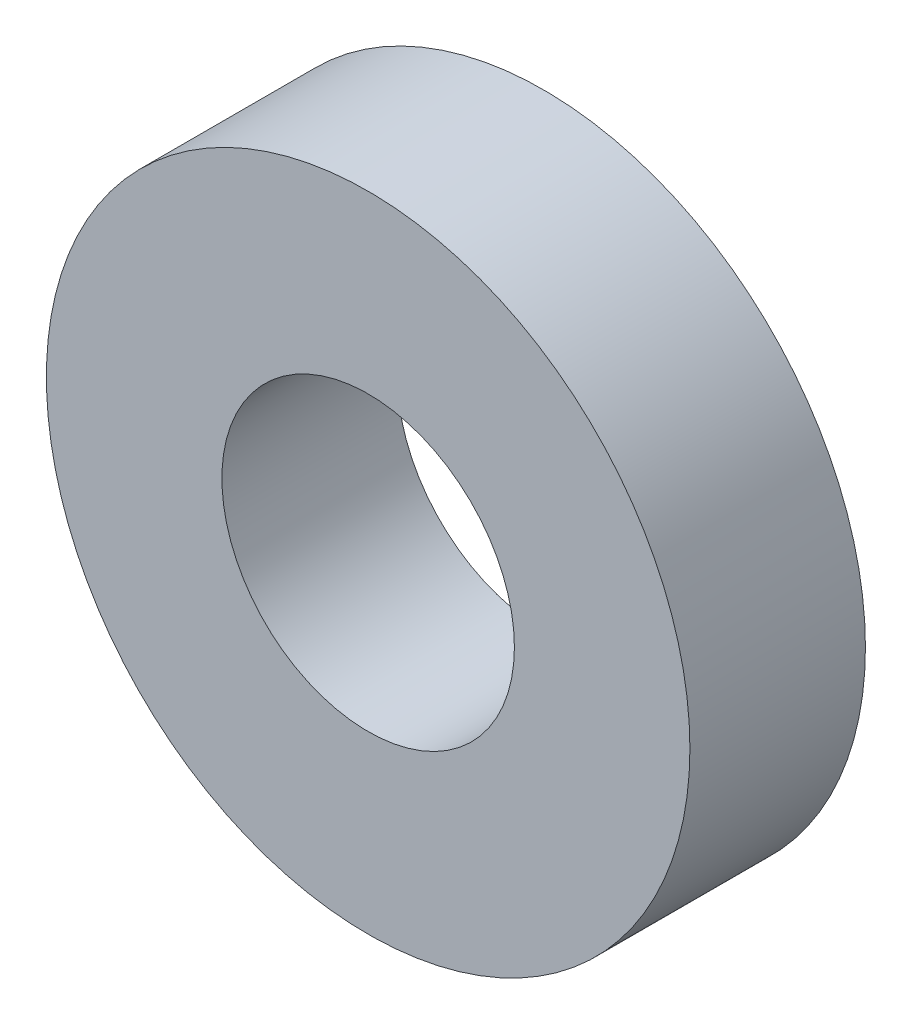
ISO-10303-21;
HEADER;
FILE_DESCRIPTION(('STEP AP214'),'2;1');
FILE_NAME('part.step','',(''),(''),'','','');
FILE_SCHEMA(('AUTOMOTIVE_DESIGN { 1 0 10303 214 1 1 1 1 }'));
ENDSEC;
DATA;
#1=APPLICATION_CONTEXT('core data for automotive mechanical design processes');
#2=APPLICATION_PROTOCOL_DEFINITION('international standard','automotive_design',2000,#1);
#3=PRODUCT_CONTEXT('',#1,'mechanical');
#4=PRODUCT('Part','Part','',(#3));
#5=PRODUCT_RELATED_PRODUCT_CATEGORY('part','',(#4));
#6=PRODUCT_DEFINITION_FORMATION('','',#4);
#7=PRODUCT_DEFINITION_CONTEXT('part definition',#1,'design');
#8=PRODUCT_DEFINITION('design','',#6,#7);
#9=PRODUCT_DEFINITION_SHAPE('','',#8);
#10=(LENGTH_UNIT() NAMED_UNIT(*) SI_UNIT(.MILLI.,.METRE.));
#11=(NAMED_UNIT(*) PLANE_ANGLE_UNIT() SI_UNIT($,.RADIAN.));
#12=(NAMED_UNIT(*) SI_UNIT($,.STERADIAN.) SOLID_ANGLE_UNIT());
#13=UNCERTAINTY_MEASURE_WITH_UNIT(LENGTH_MEASURE(1.E-05),#10,'distance_accuracy_value','');
#14=(GEOMETRIC_REPRESENTATION_CONTEXT(3) GLOBAL_UNCERTAINTY_ASSIGNED_CONTEXT((#13)) GLOBAL_UNIT_ASSIGNED_CONTEXT((#10,
#11,#12)) REPRESENTATION_CONTEXT('',''));
#15=CARTESIAN_POINT('',(0.,0.,0.));
#16=DIRECTION('',(0.,0.,1.));
#17=DIRECTION('',(1.,0.,0.));
#18=AXIS2_PLACEMENT_3D('',#15,#16,#17);
#19=CARTESIAN_POINT('',(0.,0.,3.));
#20=DIRECTION('',(0.,0.,1.));
#21=DIRECTION('',(1.,0.,0.));
#22=AXIS2_PLACEMENT_3D('',#19,#20,#21);
#23=PLANE('',#22);
#24=CARTESIAN_POINT('',(0.,0.,3.));
#25=DIRECTION('',(0.,0.,1.));
#26=DIRECTION('',(1.,0.,0.));
#27=AXIS2_PLACEMENT_3D('',#24,#25,#26);
#28=CIRCLE('',#27,5.5);
#29=CARTESIAN_POINT('',(5.5,0.,3.));
#30=VERTEX_POINT('',#29);
#31=EDGE_CURVE('E10',#30,#30,#28,.T.);
#32=ORIENTED_EDGE('',*,*,#31,.T.);
#33=EDGE_LOOP('',(#32));
#34=FACE_BOUND('',#33,.T.);
#35=CARTESIAN_POINT('',(0.,0.,3.));
#36=DIRECTION('',(0.,0.,1.));
#37=DIRECTION('',(1.,0.,0.));
#38=AXIS2_PLACEMENT_3D('',#35,#36,#37);
#39=CIRCLE('',#38,2.5);
#40=CARTESIAN_POINT('',(2.5,0.,3.));
#41=VERTEX_POINT('',#40);
#42=EDGE_CURVE('E42',#41,#41,#39,.T.);
#43=ORIENTED_EDGE('',*,*,#42,.F.);
#44=EDGE_LOOP('',(#43));
#45=FACE_BOUND('',#44,.T.);
#46=ADVANCED_FACE('F31',(#34,#45),#23,.T.);
#47=CARTESIAN_POINT('',(0.,0.,0.));
#48=DIRECTION('',(0.,0.,1.));
#49=DIRECTION('',(1.,0.,0.));
#50=AXIS2_PLACEMENT_3D('',#47,#48,#49);
#51=PLANE('',#50);
#52=CARTESIAN_POINT('',(0.,0.,0.));
#53=DIRECTION('',(0.,0.,1.));
#54=DIRECTION('',(1.,0.,0.));
#55=AXIS2_PLACEMENT_3D('',#52,#53,#54);
#56=CIRCLE('',#55,5.5);
#57=CARTESIAN_POINT('',(5.5,0.,0.));
#58=VERTEX_POINT('',#57);
#59=EDGE_CURVE('E35',#58,#58,#56,.T.);
#60=ORIENTED_EDGE('',*,*,#59,.F.);
#61=EDGE_LOOP('',(#60));
#62=FACE_BOUND('',#61,.T.);
#63=CARTESIAN_POINT('',(0.,0.,0.));
#64=DIRECTION('',(0.,0.,1.));
#65=DIRECTION('',(1.,0.,0.));
#66=AXIS2_PLACEMENT_3D('',#63,#64,#65);
#67=CIRCLE('',#66,2.5);
#68=CARTESIAN_POINT('',(2.5,0.,0.));
#69=VERTEX_POINT('',#68);
#70=EDGE_CURVE('E44',#69,#69,#67,.T.);
#71=ORIENTED_EDGE('',*,*,#70,.T.);
#72=EDGE_LOOP('',(#71));
#73=FACE_BOUND('',#72,.T.);
#74=ADVANCED_FACE('F54',(#62,#73),#51,.F.);
#75=CARTESIAN_POINT('',(0.,0.,3.));
#76=DIRECTION('',(0.,0.,-1.));
#77=DIRECTION('',(-1.,0.,0.));
#78=AXIS2_PLACEMENT_3D('',#75,#76,#77);
#79=CYLINDRICAL_SURFACE('',#78,5.5);
#80=ORIENTED_EDGE('',*,*,#31,.F.);
#81=EDGE_LOOP('',(#80));
#82=FACE_BOUND('',#81,.T.);
#83=ORIENTED_EDGE('',*,*,#59,.T.);
#84=EDGE_LOOP('',(#83));
#85=FACE_BOUND('',#84,.T.);
#86=ADVANCED_FACE('F33',(#82,#85),#79,.T.);
#87=CARTESIAN_POINT('',(0.,0.,3.));
#88=DIRECTION('',(0.,0.,-1.));
#89=DIRECTION('',(-1.,0.,0.));
#90=AXIS2_PLACEMENT_3D('',#87,#88,#89);
#91=CYLINDRICAL_SURFACE('',#90,2.5);
#92=ORIENTED_EDGE('',*,*,#42,.T.);
#93=EDGE_LOOP('',(#92));
#94=FACE_BOUND('',#93,.T.);
#95=ORIENTED_EDGE('',*,*,#70,.F.);
#96=EDGE_LOOP('',(#95));
#97=FACE_BOUND('',#96,.T.);
#98=ADVANCED_FACE('F50',(#94,#97),#91,.F.);
#99=CLOSED_SHELL('',(#46,#74,#86,#98));
#100=MANIFOLD_SOLID_BREP('B2',#99);
#101=ADVANCED_BREP_SHAPE_REPRESENTATION('',(#18,#100),#14);
#102=SHAPE_DEFINITION_REPRESENTATION(#9,#101);
ENDSEC;
END-ISO-10303-21;
